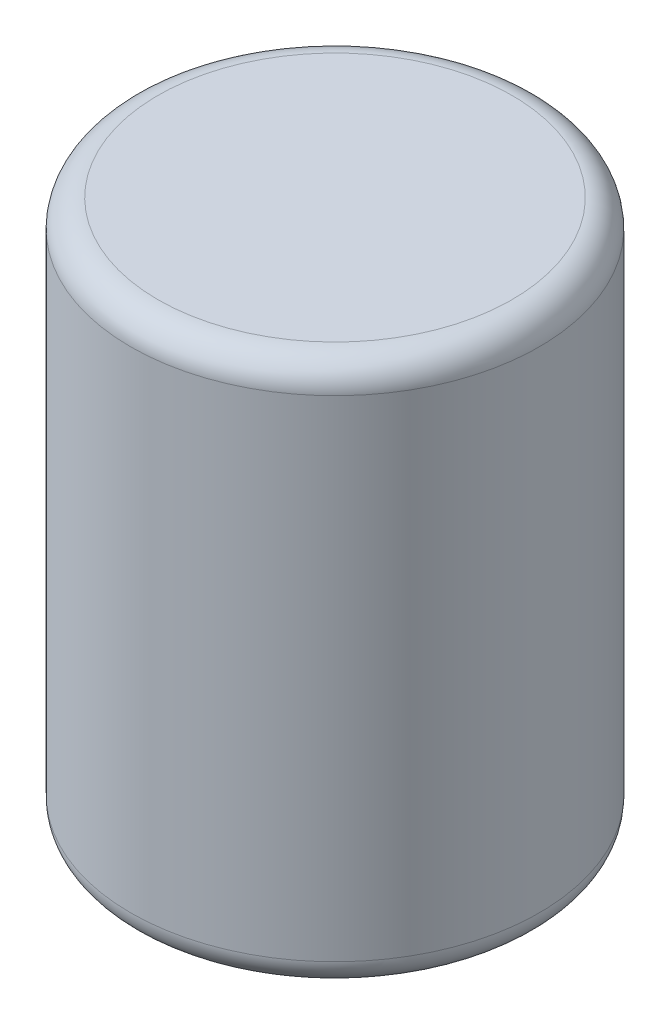
ISO-10303-21;
HEADER;
FILE_DESCRIPTION(('STEP AP214'),'2;1');
FILE_NAME('part.step','',(''),(''),'','','');
FILE_SCHEMA(('AUTOMOTIVE_DESIGN { 1 0 10303 214 1 1 1 1 }'));
ENDSEC;
DATA;
#1=APPLICATION_CONTEXT('core data for automotive mechanical design processes');
#2=APPLICATION_PROTOCOL_DEFINITION('international standard','automotive_design',2000,#1);
#3=PRODUCT_CONTEXT('',#1,'mechanical');
#4=PRODUCT('Part','Part','',(#3));
#5=PRODUCT_RELATED_PRODUCT_CATEGORY('part','',(#4));
#6=PRODUCT_DEFINITION_FORMATION('','',#4);
#7=PRODUCT_DEFINITION_CONTEXT('part definition',#1,'design');
#8=PRODUCT_DEFINITION('design','',#6,#7);
#9=PRODUCT_DEFINITION_SHAPE('','',#8);
#10=(LENGTH_UNIT() NAMED_UNIT(*) SI_UNIT(.MILLI.,.METRE.));
#11=(NAMED_UNIT(*) PLANE_ANGLE_UNIT() SI_UNIT($,.RADIAN.));
#12=(NAMED_UNIT(*) SI_UNIT($,.STERADIAN.) SOLID_ANGLE_UNIT());
#13=UNCERTAINTY_MEASURE_WITH_UNIT(LENGTH_MEASURE(1.E-05),#10,'distance_accuracy_value','');
#14=(GEOMETRIC_REPRESENTATION_CONTEXT(3) GLOBAL_UNCERTAINTY_ASSIGNED_CONTEXT((#13)) GLOBAL_UNIT_ASSIGNED_CONTEXT((#10,
#11,#12)) REPRESENTATION_CONTEXT('',''));
#15=CARTESIAN_POINT('',(0.,0.,0.));
#16=DIRECTION('',(0.,0.,1.));
#17=DIRECTION('',(1.,0.,0.));
#18=AXIS2_PLACEMENT_3D('',#15,#16,#17);
#19=CARTESIAN_POINT('',(0.,2000.,0.));
#20=DIRECTION('',(0.,-1.,0.));
#21=DIRECTION('',(0.,0.,-1.));
#22=AXIS2_PLACEMENT_3D('',#19,#20,#21);
#23=CYLINDRICAL_SURFACE('',#22,750.);
#24=CARTESIAN_POINT('',(0.,100.,0.));
#25=DIRECTION('',(0.,1.,0.));
#26=DIRECTION('',(0.,0.,1.));
#27=AXIS2_PLACEMENT_3D('',#24,#25,#26);
#28=CIRCLE('',#27,750.);
#29=CARTESIAN_POINT('',(0.,100.,750.));
#30=VERTEX_POINT('',#29);
#31=EDGE_CURVE('E50',#30,#30,#28,.T.);
#32=ORIENTED_EDGE('',*,*,#31,.T.);
#33=EDGE_LOOP('',(#32));
#34=FACE_BOUND('',#33,.T.);
#35=CARTESIAN_POINT('',(0.,1900.,0.));
#36=DIRECTION('',(0.,1.,0.));
#37=DIRECTION('',(0.,0.,1.));
#38=AXIS2_PLACEMENT_3D('',#35,#36,#37);
#39=CIRCLE('',#38,750.);
#40=CARTESIAN_POINT('',(0.,1900.,750.));
#41=VERTEX_POINT('',#40);
#42=EDGE_CURVE('E55',#41,#41,#39,.F.);
#43=ORIENTED_EDGE('',*,*,#42,.T.);
#44=EDGE_LOOP('',(#43));
#45=FACE_BOUND('',#44,.T.);
#46=ADVANCED_FACE('F37',(#34,#45),#23,.T.);
#47=CARTESIAN_POINT('',(0.,2000.,0.));
#48=DIRECTION('',(0.,1.,0.));
#49=DIRECTION('',(0.,0.,1.));
#50=AXIS2_PLACEMENT_3D('',#47,#48,#49);
#51=PLANE('',#50);
#52=CARTESIAN_POINT('',(0.,2000.,0.));
#53=DIRECTION('',(0.,1.,0.));
#54=DIRECTION('',(0.,0.,1.));
#55=AXIS2_PLACEMENT_3D('',#52,#53,#54);
#56=CIRCLE('',#55,650.);
#57=CARTESIAN_POINT('',(0.,2000.,650.));
#58=VERTEX_POINT('',#57);
#59=EDGE_CURVE('E10',#58,#58,#56,.T.);
#60=ORIENTED_EDGE('',*,*,#59,.T.);
#61=EDGE_LOOP('',(#60));
#62=FACE_BOUND('',#61,.T.);
#63=ADVANCED_FACE('F72',(#62),#51,.T.);
#64=CARTESIAN_POINT('',(0.,0.,0.));
#65=DIRECTION('',(0.,1.,0.));
#66=DIRECTION('',(0.,0.,1.));
#67=AXIS2_PLACEMENT_3D('',#64,#65,#66);
#68=PLANE('',#67);
#69=CARTESIAN_POINT('',(0.,0.,0.));
#70=DIRECTION('',(0.,1.,0.));
#71=DIRECTION('',(0.,0.,1.));
#72=AXIS2_PLACEMENT_3D('',#69,#70,#71);
#73=CIRCLE('',#72,650.);
#74=CARTESIAN_POINT('',(0.,0.,650.));
#75=VERTEX_POINT('',#74);
#76=EDGE_CURVE('E45',#75,#75,#73,.F.);
#77=ORIENTED_EDGE('',*,*,#76,.T.);
#78=EDGE_LOOP('',(#77));
#79=FACE_BOUND('',#78,.T.);
#80=ADVANCED_FACE('F69',(#79),#68,.F.);
#81=CARTESIAN_POINT('',(0.,100.,0.));
#82=DIRECTION('',(0.,1.,0.));
#83=DIRECTION('',(0.,0.,1.));
#84=AXIS2_PLACEMENT_3D('',#81,#82,#83);
#85=TOROIDAL_SURFACE('',#84,650.,100.);
#86=ORIENTED_EDGE('',*,*,#76,.F.);
#87=EDGE_LOOP('',(#86));
#88=FACE_BOUND('',#87,.T.);
#89=ORIENTED_EDGE('',*,*,#31,.F.);
#90=EDGE_LOOP('',(#89));
#91=FACE_BOUND('',#90,.T.);
#92=ADVANCED_FACE('F65',(#88,#91),#85,.T.);
#93=CARTESIAN_POINT('',(0.,1900.,0.));
#94=DIRECTION('',(0.,1.,0.));
#95=DIRECTION('',(0.,0.,1.));
#96=AXIS2_PLACEMENT_3D('',#93,#94,#95);
#97=TOROIDAL_SURFACE('',#96,650.,100.);
#98=ORIENTED_EDGE('',*,*,#42,.F.);
#99=EDGE_LOOP('',(#98));
#100=FACE_BOUND('',#99,.T.);
#101=ORIENTED_EDGE('',*,*,#59,.F.);
#102=EDGE_LOOP('',(#101));
#103=FACE_BOUND('',#102,.T.);
#104=ADVANCED_FACE('F39',(#100,#103),#97,.T.);
#105=CLOSED_SHELL('',(#46,#63,#80,#92,#104));
#106=MANIFOLD_SOLID_BREP('B2',#105);
#107=ADVANCED_BREP_SHAPE_REPRESENTATION('',(#18,#106),#14);
#108=SHAPE_DEFINITION_REPRESENTATION(#9,#107);
ENDSEC;
END-ISO-10303-21;
